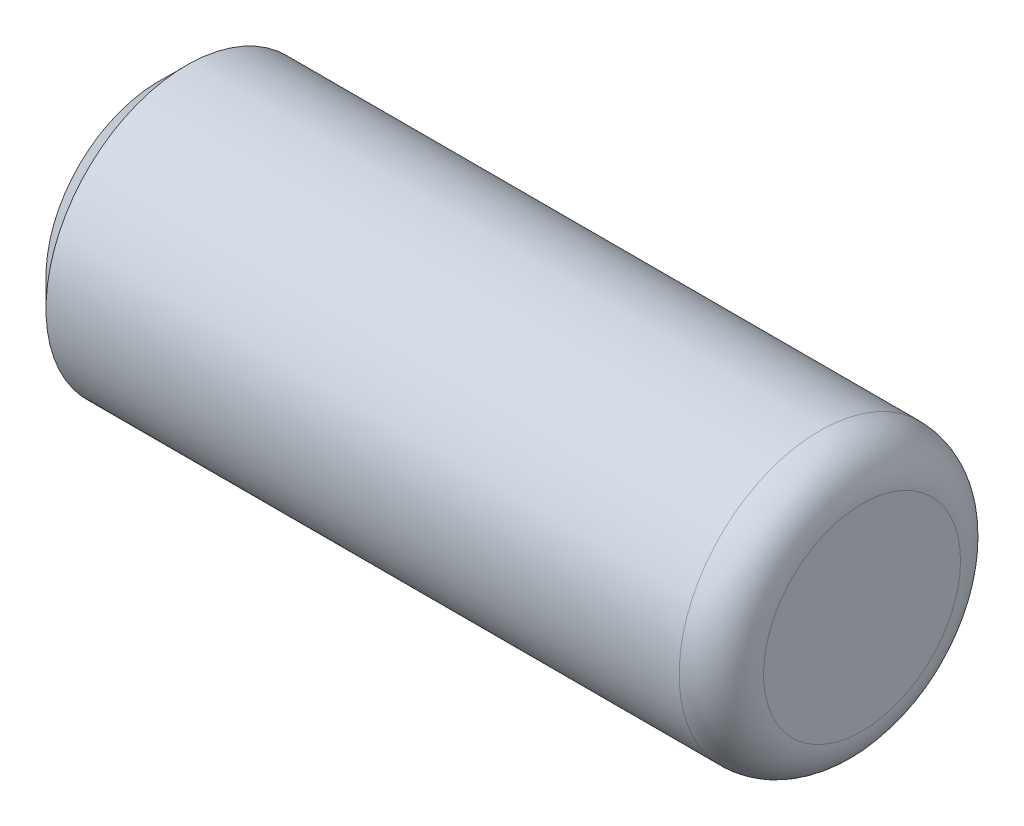
ISO-10303-21;
HEADER;
FILE_DESCRIPTION(('STEP AP214'),'2;1');
FILE_NAME('part.step','',(''),(''),'','','');
FILE_SCHEMA(('AUTOMOTIVE_DESIGN { 1 0 10303 214 1 1 1 1 }'));
ENDSEC;
DATA;
#1=APPLICATION_CONTEXT('core data for automotive mechanical design processes');
#2=APPLICATION_PROTOCOL_DEFINITION('international standard','automotive_design',2000,#1);
#3=PRODUCT_CONTEXT('',#1,'mechanical');
#4=PRODUCT('Part','Part','',(#3));
#5=PRODUCT_RELATED_PRODUCT_CATEGORY('part','',(#4));
#6=PRODUCT_DEFINITION_FORMATION('','',#4);
#7=PRODUCT_DEFINITION_CONTEXT('part definition',#1,'design');
#8=PRODUCT_DEFINITION('design','',#6,#7);
#9=PRODUCT_DEFINITION_SHAPE('','',#8);
#10=(LENGTH_UNIT() NAMED_UNIT(*) SI_UNIT(.MILLI.,.METRE.));
#11=(NAMED_UNIT(*) PLANE_ANGLE_UNIT() SI_UNIT($,.RADIAN.));
#12=(NAMED_UNIT(*) SI_UNIT($,.STERADIAN.) SOLID_ANGLE_UNIT());
#13=UNCERTAINTY_MEASURE_WITH_UNIT(LENGTH_MEASURE(1.E-05),#10,'distance_accuracy_value','');
#14=(GEOMETRIC_REPRESENTATION_CONTEXT(3) GLOBAL_UNCERTAINTY_ASSIGNED_CONTEXT((#13)) GLOBAL_UNIT_ASSIGNED_CONTEXT((#10,
#11,#12)) REPRESENTATION_CONTEXT('',''));
#15=CARTESIAN_POINT('',(0.,0.,0.));
#16=DIRECTION('',(0.,0.,1.));
#17=DIRECTION('',(1.,0.,0.));
#18=AXIS2_PLACEMENT_3D('',#15,#16,#17);
#19=CARTESIAN_POINT('',(2.5,0.,0.));
#20=DIRECTION('',(-1.,0.,0.));
#21=DIRECTION('',(0.,0.,1.));
#22=AXIS2_PLACEMENT_3D('',#19,#20,#21);
#23=CYLINDRICAL_SURFACE('',#22,1.);
#24=CARTESIAN_POINT('',(-2.3,0.,0.));
#25=DIRECTION('',(1.,0.,0.));
#26=DIRECTION('',(0.,0.,-1.));
#27=AXIS2_PLACEMENT_3D('',#24,#25,#26);
#28=CIRCLE('',#27,1.);
#29=CARTESIAN_POINT('',(-2.3,0.,-1.));
#30=VERTEX_POINT('',#29);
#31=EDGE_CURVE('E48',#30,#30,#28,.T.);
#32=ORIENTED_EDGE('',*,*,#31,.T.);
#33=EDGE_LOOP('',(#32));
#34=FACE_BOUND('',#33,.T.);
#35=CARTESIAN_POINT('',(2.2,0.,0.));
#36=DIRECTION('',(1.,0.,0.));
#37=DIRECTION('',(0.,0.,-1.));
#38=AXIS2_PLACEMENT_3D('',#35,#36,#37);
#39=CIRCLE('',#38,1.);
#40=CARTESIAN_POINT('',(2.2,0.,-1.));
#41=VERTEX_POINT('',#40);
#42=EDGE_CURVE('E52',#41,#41,#39,.F.);
#43=ORIENTED_EDGE('',*,*,#42,.T.);
#44=EDGE_LOOP('',(#43));
#45=FACE_BOUND('',#44,.T.);
#46=ADVANCED_FACE('F40',(#34,#45),#23,.T.);
#47=CARTESIAN_POINT('',(2.5,0.,0.));
#48=DIRECTION('',(1.,0.,0.));
#49=DIRECTION('',(0.,0.,-1.));
#50=AXIS2_PLACEMENT_3D('',#47,#48,#49);
#51=PLANE('',#50);
#52=CARTESIAN_POINT('',(2.5,0.,0.));
#53=DIRECTION('',(1.,0.,0.));
#54=DIRECTION('',(0.,0.,-1.));
#55=AXIS2_PLACEMENT_3D('',#52,#53,#54);
#56=CIRCLE('',#55,0.7);
#57=CARTESIAN_POINT('',(2.5,0.,-0.7));
#58=VERTEX_POINT('',#57);
#59=EDGE_CURVE('E56',#58,#58,#56,.T.);
#60=ORIENTED_EDGE('',*,*,#59,.T.);
#61=EDGE_LOOP('',(#60));
#62=FACE_BOUND('',#61,.T.);
#63=ADVANCED_FACE('F62',(#62),#51,.T.);
#64=CARTESIAN_POINT('',(-2.5,0.,0.));
#65=DIRECTION('',(1.,0.,0.));
#66=DIRECTION('',(0.,0.,-1.));
#67=AXIS2_PLACEMENT_3D('',#64,#65,#66);
#68=PLANE('',#67);
#69=CARTESIAN_POINT('',(-2.5,0.,0.));
#70=DIRECTION('',(1.,0.,0.));
#71=DIRECTION('',(0.,0.,-1.));
#72=AXIS2_PLACEMENT_3D('',#69,#70,#71);
#73=CIRCLE('',#72,0.799999999999997);
#74=CARTESIAN_POINT('',(-2.5,0.,-0.799999999999997));
#75=VERTEX_POINT('',#74);
#76=EDGE_CURVE('E10',#75,#75,#73,.F.);
#77=ORIENTED_EDGE('',*,*,#76,.T.);
#78=EDGE_LOOP('',(#77));
#79=FACE_BOUND('',#78,.T.);
#80=ADVANCED_FACE('F66',(#79),#68,.F.);
#81=CARTESIAN_POINT('',(2.2,0.,0.));
#82=DIRECTION('',(1.,0.,0.));
#83=DIRECTION('',(0.,0.,-1.));
#84=AXIS2_PLACEMENT_3D('',#81,#82,#83);
#85=TOROIDAL_SURFACE('',#84,0.7,0.3);
#86=ORIENTED_EDGE('',*,*,#42,.F.);
#87=EDGE_LOOP('',(#86));
#88=FACE_BOUND('',#87,.T.);
#89=ORIENTED_EDGE('',*,*,#59,.F.);
#90=EDGE_LOOP('',(#89));
#91=FACE_BOUND('',#90,.T.);
#92=ADVANCED_FACE('F64',(#88,#91),#85,.T.);
#93=CARTESIAN_POINT('',(-2.3,0.,0.));
#94=DIRECTION('',(1.,0.,0.));
#95=DIRECTION('',(0.,0.,-1.));
#96=AXIS2_PLACEMENT_3D('',#93,#94,#95);
#97=CONICAL_SURFACE('',#96,1.,0.785398163397451);
#98=ORIENTED_EDGE('',*,*,#76,.F.);
#99=EDGE_LOOP('',(#98));
#100=FACE_BOUND('',#99,.T.);
#101=ORIENTED_EDGE('',*,*,#31,.F.);
#102=EDGE_LOOP('',(#101));
#103=FACE_BOUND('',#102,.T.);
#104=ADVANCED_FACE('F43',(#100,#103),#97,.T.);
#105=CLOSED_SHELL('',(#46,#63,#80,#92,#104));
#106=MANIFOLD_SOLID_BREP('B2',#105);
#107=ADVANCED_BREP_SHAPE_REPRESENTATION('',(#18,#106),#14);
#108=SHAPE_DEFINITION_REPRESENTATION(#9,#107);
ENDSEC;
END-ISO-10303-21;
